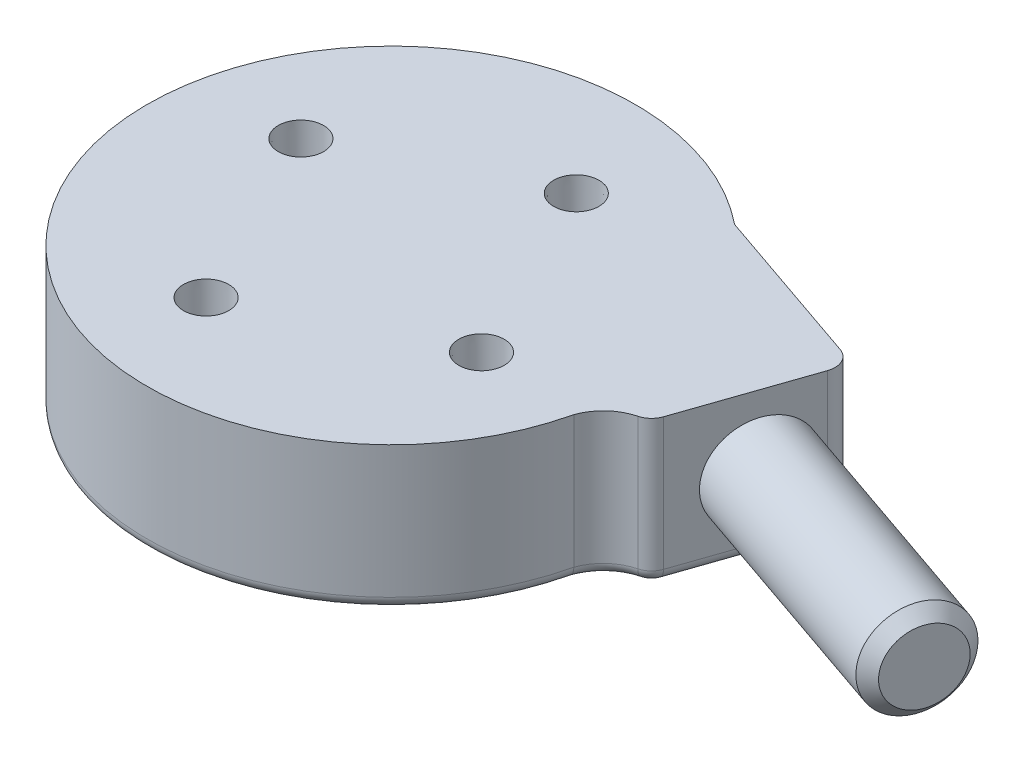
ISO-10303-21;
HEADER;
FILE_DESCRIPTION(('STEP AP214'),'2;1');
FILE_NAME('part.step','',(''),(''),'','','');
FILE_SCHEMA(('AUTOMOTIVE_DESIGN { 1 0 10303 214 1 1 1 1 }'));
ENDSEC;
DATA;
#1=APPLICATION_CONTEXT('core data for automotive mechanical design processes');
#2=APPLICATION_PROTOCOL_DEFINITION('international standard','automotive_design',2000,#1);
#3=PRODUCT_CONTEXT('',#1,'mechanical');
#4=PRODUCT('Part','Part','',(#3));
#5=PRODUCT_RELATED_PRODUCT_CATEGORY('part','',(#4));
#6=PRODUCT_DEFINITION_FORMATION('','',#4);
#7=PRODUCT_DEFINITION_CONTEXT('part definition',#1,'design');
#8=PRODUCT_DEFINITION('design','',#6,#7);
#9=PRODUCT_DEFINITION_SHAPE('','',#8);
#10=(LENGTH_UNIT() NAMED_UNIT(*) SI_UNIT(.MILLI.,.METRE.));
#11=(NAMED_UNIT(*) PLANE_ANGLE_UNIT() SI_UNIT($,.RADIAN.));
#12=(NAMED_UNIT(*) SI_UNIT($,.STERADIAN.) SOLID_ANGLE_UNIT());
#13=UNCERTAINTY_MEASURE_WITH_UNIT(LENGTH_MEASURE(1.E-05),#10,'distance_accuracy_value','');
#14=(GEOMETRIC_REPRESENTATION_CONTEXT(3) GLOBAL_UNCERTAINTY_ASSIGNED_CONTEXT((#13)) GLOBAL_UNIT_ASSIGNED_CONTEXT((#10,
#11,#12)) REPRESENTATION_CONTEXT('',''));
#15=CARTESIAN_POINT('',(0.,0.,0.));
#16=DIRECTION('',(0.,0.,1.));
#17=DIRECTION('',(1.,0.,0.));
#18=AXIS2_PLACEMENT_3D('',#15,#16,#17);
#19=CARTESIAN_POINT('',(-264.046286298938,-160.663775743606,-242.023928087351));
#20=DIRECTION('',(0.,-1.,0.));
#21=DIRECTION('',(0.,0.,-1.00000000000001));
#22=AXIS2_PLACEMENT_3D('',#19,#20,#21);
#23=PLANE('',#22);
#24=CARTESIAN_POINT('',(-245.852404074912,-160.663775743606,-235.758135864115));
#25=DIRECTION('',(0.,1.,0.));
#26=DIRECTION('',(0.,0.,1.00000000000001));
#27=AXIS2_PLACEMENT_3D('',#24,#25,#26);
#28=CIRCLE('',#27,2.99720000000001);
#29=CARTESIAN_POINT('',(-245.852404074912,-160.663775743606,-232.760935864115));
#30=VERTEX_POINT('',#29);
#31=EDGE_CURVE('E147',#30,#30,#28,.T.);
#32=ORIENTED_EDGE('',*,*,#31,.F.);
#33=EDGE_LOOP('',(#32));
#34=FACE_BOUND('',#33,.T.);
#35=CARTESIAN_POINT('',(-270.312078522173,-160.663775743606,-223.830045863326));
#36=DIRECTION('',(0.,1.,0.));
#37=DIRECTION('',(0.,0.,1.00000000000001));
#38=AXIS2_PLACEMENT_3D('',#35,#36,#37);
#39=CIRCLE('',#38,2.99720000000003);
#40=CARTESIAN_POINT('',(-270.312078522173,-160.663775743606,-220.832845863326));
#41=VERTEX_POINT('',#40);
#42=EDGE_CURVE('E153',#41,#41,#39,.T.);
#43=ORIENTED_EDGE('',*,*,#42,.F.);
#44=EDGE_LOOP('',(#43));
#45=FACE_BOUND('',#44,.T.);
#46=CARTESIAN_POINT('',(-257.780494075701,-160.663775743606,-260.217810311378));
#47=DIRECTION('',(0.,1.,0.));
#48=DIRECTION('',(0.,0.,1.00000000000001));
#49=AXIS2_PLACEMENT_3D('',#46,#47,#48);
#50=CIRCLE('',#49,2.99720000000003);
#51=CARTESIAN_POINT('',(-257.780494075701,-160.663775743606,-257.220610311378));
#52=VERTEX_POINT('',#51);
#53=EDGE_CURVE('E165',#52,#52,#50,.T.);
#54=ORIENTED_EDGE('',*,*,#53,.F.);
#55=EDGE_LOOP('',(#54));
#56=FACE_BOUND('',#55,.T.);
#57=DIRECTION('',(-0.325620940566078,0.,0.945500398236233));
#58=VECTOR('',#57,1.);
#59=CARTESIAN_POINT('',(-226.943146120788,-160.663775743606,-238.965283020514));
#60=LINE('',#59,#58);
#61=CARTESIAN_POINT('',(-220.887958291581,-160.663775743605,-256.547636581552));
#62=VERTEX_POINT('',#61);
#63=CARTESIAN_POINT('',(-226.447767440721,-160.663775743606,-240.403706294109));
#64=VERTEX_POINT('',#63);
#65=EDGE_CURVE('E177',#62,#64,#60,.T.);
#66=ORIENTED_EDGE('',*,*,#65,.F.);
#67=CARTESIAN_POINT('',(-223.289529303101,-160.663775743606,-257.374713770591));
#68=DIRECTION('',(0.,-1.,0.));
#69=DIRECTION('',(0.,0.,-1.00000000000001));
#70=AXIS2_PLACEMENT_3D('',#67,#68,#69);
#71=CIRCLE('',#70,2.54);
#72=CARTESIAN_POINT('',(-222.462452114064,-160.663775743606,-259.776284782109));
#73=VERTEX_POINT('',#72);
#74=EDGE_CURVE('E206',#62,#73,#71,.F.);
#75=ORIENTED_EDGE('',*,*,#74,.T.);
#76=DIRECTION('',(0.945500398236233,0.,0.325620940566077));
#77=VECTOR('',#76,1.);
#78=CARTESIAN_POINT('',(-220.060881102543,-160.663775743606,-258.94920759307));
#79=LINE('',#78,#77);
#80=CARTESIAN_POINT('',(-243.756619181763,-160.663775743605,-267.10978429421));
#81=VERTEX_POINT('',#80);
#82=EDGE_CURVE('E181',#81,#73,#79,.T.);
#83=ORIENTED_EDGE('',*,*,#82,.F.);
#84=CARTESIAN_POINT('',(-264.046286298938,-160.663775743606,-242.023928087351));
#85=DIRECTION('',(0.,-1.,0.));
#86=DIRECTION('',(0.,0.,-1.00000000000001));
#87=AXIS2_PLACEMENT_3D('',#84,#85,#86);
#88=CIRCLE('',#87,32.264078684458);
#89=CARTESIAN_POINT('',(-232.618969714269,-160.663775743604,-234.723616748524));
#90=VERTEX_POINT('',#89);
#91=EDGE_CURVE('E176',#90,#81,#88,.T.);
#92=ORIENTED_EDGE('',*,*,#91,.F.);
#93=CARTESIAN_POINT('',(-226.626416439824,-160.663775743606,-232.623186970375));
#94=DIRECTION('',(0.,-1.,0.));
#95=DIRECTION('',(0.,0.,-1.00000000000001));
#96=AXIS2_PLACEMENT_3D('',#93,#94,#95);
#97=CIRCLE('',#96,6.35);
#98=CARTESIAN_POINT('',(-228.214217877266,-160.663775743605,-238.771470193785));
#99=VERTEX_POINT('',#98);
#100=EDGE_CURVE('E195',#90,#99,#97,.T.);
#101=ORIENTED_EDGE('',*,*,#100,.T.);
#102=CARTESIAN_POINT('',(-228.849338452243,-160.663775743605,-241.230783483149));
#103=DIRECTION('',(0.,-1.,0.));
#104=DIRECTION('',(0.,0.,-1.00000000000001));
#105=AXIS2_PLACEMENT_3D('',#102,#103,#104);
#106=CIRCLE('',#105,2.54);
#107=EDGE_CURVE('E204',#99,#64,#106,.F.);
#108=ORIENTED_EDGE('',*,*,#107,.T.);
#109=EDGE_LOOP('',(#66,#75,#83,#92,#101,#108));
#110=FACE_BOUND('',#109,.T.);
#111=CARTESIAN_POINT('',(-282.240168522964,-160.663775743605,-248.289720310586));
#112=DIRECTION('',(0.,1.,0.));
#113=DIRECTION('',(0.,0.,1.00000000000001));
#114=AXIS2_PLACEMENT_3D('',#111,#112,#113);
#115=CIRCLE('',#114,2.99720000000003);
#116=CARTESIAN_POINT('',(-282.240168522964,-160.663775743605,-245.292520310586));
#117=VERTEX_POINT('',#116);
#118=EDGE_CURVE('E159',#117,#117,#115,.T.);
#119=ORIENTED_EDGE('',*,*,#118,.F.);
#120=EDGE_LOOP('',(#119));
#121=FACE_BOUND('',#120,.T.);
#122=ADVANCED_FACE('F40',(#34,#45,#56,#110,#121),#23,.F.);
#123=CARTESIAN_POINT('',(-264.046286298938,-175.975505735528,-242.023928087351));
#124=DIRECTION('',(0.,1.,0.));
#125=DIRECTION('',(0.,0.,1.00000000000001));
#126=AXIS2_PLACEMENT_3D('',#123,#124,#125);
#127=CYLINDRICAL_SURFACE('',#126,32.264078684458);
#128=DIRECTION('',(0.,-1.,0.));
#129=VECTOR('',#128,1.);
#130=CARTESIAN_POINT('',(-243.756619181763,-163.275505735527,-267.10978429421));
#131=LINE('',#130,#129);
#132=CARTESIAN_POINT('',(-243.756619181762,-178.126275743605,-267.109784294209));
#133=VERTEX_POINT('',#132);
#134=EDGE_CURVE('E180',#81,#133,#131,.T.);
#135=ORIENTED_EDGE('',*,*,#134,.T.);
#136=CARTESIAN_POINT('',(-264.046286298938,-178.126275743606,-242.023928087351));
#137=DIRECTION('',(0.,-1.,0.));
#138=DIRECTION('',(0.,0.,-1.00000000000001));
#139=AXIS2_PLACEMENT_3D('',#136,#137,#138);
#140=CIRCLE('',#139,32.264078684458);
#141=CARTESIAN_POINT('',(-232.618969714268,-178.126275743604,-234.723616748525));
#142=VERTEX_POINT('',#141);
#143=EDGE_CURVE('E223',#133,#142,#140,.F.);
#144=ORIENTED_EDGE('',*,*,#143,.T.);
#145=DIRECTION('',(0.,1.,0.));
#146=VECTOR('',#145,1.);
#147=CARTESIAN_POINT('',(-232.618969714269,-170.188775743604,-234.723616748525));
#148=LINE('',#147,#146);
#149=EDGE_CURVE('E193',#142,#90,#148,.T.);
#150=ORIENTED_EDGE('',*,*,#149,.T.);
#151=ORIENTED_EDGE('',*,*,#91,.T.);
#152=EDGE_LOOP('',(#135,#144,#150,#151));
#153=FACE_BOUND('',#152,.T.);
#154=ADVANCED_FACE('F273',(#153),#127,.T.);
#155=CARTESIAN_POINT('',(-220.060881102543,-163.275505735528,-258.94920759307));
#156=DIRECTION('',(0.945500398236233,0.,0.325620940566078));
#157=DIRECTION('',(0.325620940566078,0.,-0.945500398236233));
#158=AXIS2_PLACEMENT_3D('',#155,#156,#157);
#159=PLANE('',#158);
#160=CARTESIAN_POINT('',(-223.163344663644,-170.188775743606,-249.940632998837));
#161=DIRECTION('',(0.945500398236233,0.,0.325620940566078));
#162=DIRECTION('',(0.325620940566078,0.,-0.945500398236233));
#163=AXIS2_PLACEMENT_3D('',#160,#161,#162);
#164=CIRCLE('',#163,6.35);
#165=CARTESIAN_POINT('',(-221.095651691049,-170.188775743606,-255.944560527637));
#166=VERTEX_POINT('',#165);
#167=EDGE_CURVE('E172',#166,#166,#164,.T.);
#168=ORIENTED_EDGE('',*,*,#167,.F.);
#169=EDGE_LOOP('',(#168));
#170=FACE_BOUND('',#169,.T.);
#171=DIRECTION('',(0.,-1.,0.));
#172=VECTOR('',#171,1.);
#173=CARTESIAN_POINT('',(-226.447767440722,-179.713775743606,-240.40370629411));
#174=LINE('',#173,#172);
#175=CARTESIAN_POINT('',(-226.447767440721,-178.126275743606,-240.40370629411));
#176=VERTEX_POINT('',#175);
#177=EDGE_CURVE('E200',#64,#176,#174,.T.);
#178=ORIENTED_EDGE('',*,*,#177,.T.);
#179=DIRECTION('',(-0.325620940566078,0.,0.945500398236233));
#180=VECTOR('',#179,1.);
#181=CARTESIAN_POINT('',(-220.060881102542,-178.126275743606,-258.949207593071));
#182=LINE('',#181,#180);
#183=CARTESIAN_POINT('',(-220.88795829158,-178.126275743605,-256.547636581552));
#184=VERTEX_POINT('',#183);
#185=EDGE_CURVE('E64',#176,#184,#182,.F.);
#186=ORIENTED_EDGE('',*,*,#185,.T.);
#187=DIRECTION('',(0.,-1.,0.));
#188=VECTOR('',#187,1.);
#189=CARTESIAN_POINT('',(-220.887958291581,-163.275505735527,-256.547636581552));
#190=LINE('',#189,#188);
#191=EDGE_CURVE('E202',#184,#62,#190,.F.);
#192=ORIENTED_EDGE('',*,*,#191,.T.);
#193=ORIENTED_EDGE('',*,*,#65,.T.);
#194=EDGE_LOOP('',(#178,#186,#192,#193));
#195=FACE_BOUND('',#194,.T.);
#196=ADVANCED_FACE('F279',(#170,#195),#159,.T.);
#197=CARTESIAN_POINT('',(-243.756619181763,-163.275505735527,-267.10978429421));
#198=DIRECTION('',(0.325620940566077,0.,-0.945500398236233));
#199=DIRECTION('',(-0.945500398236233,0.,-0.325620940566077));
#200=AXIS2_PLACEMENT_3D('',#197,#198,#199);
#201=PLANE('',#200);
#202=DIRECTION('',(0.,-1.,0.));
#203=VECTOR('',#202,1.);
#204=CARTESIAN_POINT('',(-222.462452114064,-163.275505735528,-259.776284782109));
#205=LINE('',#204,#203);
#206=CARTESIAN_POINT('',(-222.462452114063,-178.126275743606,-259.776284782111));
#207=VERTEX_POINT('',#206);
#208=EDGE_CURVE('E198',#73,#207,#205,.T.);
#209=ORIENTED_EDGE('',*,*,#208,.T.);
#210=DIRECTION('',(0.945500398236233,0.,0.325620940566077));
#211=VECTOR('',#210,1.);
#212=CARTESIAN_POINT('',(-243.756619181762,-178.126275743605,-267.109784294209));
#213=LINE('',#212,#211);
#214=EDGE_CURVE('E12',#207,#133,#213,.F.);
#215=ORIENTED_EDGE('',*,*,#214,.T.);
#216=ORIENTED_EDGE('',*,*,#134,.F.);
#217=ORIENTED_EDGE('',*,*,#82,.T.);
#218=EDGE_LOOP('',(#209,#215,#216,#217));
#219=FACE_BOUND('',#218,.T.);
#220=ADVANCED_FACE('F285',(#219),#201,.T.);
#221=CARTESIAN_POINT('',(-264.046286298938,-179.713775743606,-242.023928087351));
#222=DIRECTION('',(0.,-1.,0.));
#223=DIRECTION('',(0.,0.,-1.00000000000001));
#224=AXIS2_PLACEMENT_3D('',#221,#222,#223);
#225=PLANE('',#224);
#226=CARTESIAN_POINT('',(-226.626416439824,-179.713775743606,-232.623186970375));
#227=DIRECTION('',(0.,-1.,0.));
#228=DIRECTION('',(0.,0.,-1.00000000000001));
#229=AXIS2_PLACEMENT_3D('',#226,#227,#228);
#230=CIRCLE('',#229,7.9375);
#231=CARTESIAN_POINT('',(-228.611168236625,-179.713775743605,-240.308540999639));
#232=VERTEX_POINT('',#231);
#233=CARTESIAN_POINT('',(-234.147165949107,-179.713775743604,-235.161342416486));
#234=VERTEX_POINT('',#233);
#235=EDGE_CURVE('E218',#232,#234,#230,.F.);
#236=ORIENTED_EDGE('',*,*,#235,.T.);
#237=CARTESIAN_POINT('',(-264.046286298938,-179.713775743606,-242.023928087351));
#238=DIRECTION('',(0.,-1.,0.));
#239=DIRECTION('',(0.,0.,-1.00000000000001));
#240=AXIS2_PLACEMENT_3D('',#237,#238,#239);
#241=CIRCLE('',#240,30.676578684458);
#242=CARTESIAN_POINT('',(-244.541144822364,-179.713775743606,-265.700962018201));
#243=VERTEX_POINT('',#242);
#244=EDGE_CURVE('E220',#234,#243,#241,.T.);
#245=ORIENTED_EDGE('',*,*,#244,.T.);
#246=DIRECTION('',(0.945500398236233,0.,0.325620940566077));
#247=VECTOR('',#246,1.);
#248=CARTESIAN_POINT('',(-254.688615308605,-179.713775743606,-269.19565000592));
#249=LINE('',#248,#247);
#250=CARTESIAN_POINT('',(-222.97937535721,-179.713775743606,-258.27530289991));
#251=VERTEX_POINT('',#250);
#252=EDGE_CURVE('E210',#243,#251,#249,.T.);
#253=ORIENTED_EDGE('',*,*,#252,.T.);
#254=CARTESIAN_POINT('',(-223.289529303101,-179.713775743606,-257.37471377059));
#255=DIRECTION('',(0.,-1.,0.));
#256=DIRECTION('',(0.,0.,-1.00000000000001));
#257=AXIS2_PLACEMENT_3D('',#254,#255,#256);
#258=CIRCLE('',#257,0.9525);
#259=CARTESIAN_POINT('',(-222.388940173779,-179.713775743605,-257.0645598247));
#260=VERTEX_POINT('',#259);
#261=EDGE_CURVE('E212',#251,#260,#258,.T.);
#262=ORIENTED_EDGE('',*,*,#261,.T.);
#263=DIRECTION('',(-0.325620940566078,0.,0.945500398236233));
#264=VECTOR('',#263,1.);
#265=CARTESIAN_POINT('',(-231.436457218225,-179.713775743605,-230.793427035455));
#266=LINE('',#265,#264);
#267=CARTESIAN_POINT('',(-227.948749322922,-179.713775743605,-240.920629537262));
#268=VERTEX_POINT('',#267);
#269=EDGE_CURVE('E214',#260,#268,#266,.T.);
#270=ORIENTED_EDGE('',*,*,#269,.T.);
#271=CARTESIAN_POINT('',(-228.849338452241,-179.713775743605,-241.230783483148));
#272=DIRECTION('',(0.,-1.,0.));
#273=DIRECTION('',(0.,0.,-1.00000000000001));
#274=AXIS2_PLACEMENT_3D('',#271,#272,#273);
#275=CIRCLE('',#274,0.9525);
#276=EDGE_CURVE('E216',#268,#232,#275,.T.);
#277=ORIENTED_EDGE('',*,*,#276,.T.);
#278=EDGE_LOOP('',(#236,#245,#253,#262,#270,#277));
#279=FACE_BOUND('',#278,.T.);
#280=ADVANCED_FACE('F397',(#279),#225,.T.);
#281=CARTESIAN_POINT('',(-190.141743255245,-170.188775743606,-238.568321649567));
#282=DIRECTION('',(-0.945500398236233,0.,-0.325620940566078));
#283=DIRECTION('',(-0.325620940566078,0.,0.945500398236233));
#284=AXIS2_PLACEMENT_3D('',#281,#282,#283);
#285=CYLINDRICAL_SURFACE('',#284,6.35);
#286=CARTESIAN_POINT('',(-191.642725137444,-170.188775743606,-239.085244892717));
#287=DIRECTION('',(0.945500398236234,0.,0.325620940566075));
#288=DIRECTION('',(0.325620940566075,0.,-0.945500398236234));
#289=AXIS2_PLACEMENT_3D('',#286,#287,#288);
#290=CIRCLE('',#289,6.35);
#291=CARTESIAN_POINT('',(-189.575032164849,-170.188775743606,-245.089172421517));
#292=VERTEX_POINT('',#291);
#293=EDGE_CURVE('E190',#292,#292,#290,.F.);
#294=ORIENTED_EDGE('',*,*,#293,.T.);
#295=EDGE_LOOP('',(#294));
#296=FACE_BOUND('',#295,.T.);
#297=ORIENTED_EDGE('',*,*,#167,.T.);
#298=EDGE_LOOP('',(#297));
#299=FACE_BOUND('',#298,.T.);
#300=ADVANCED_FACE('F393',(#296,#299),#285,.T.);
#301=CARTESIAN_POINT('',(-190.141743255245,-170.188775743606,-238.568321649567));
#302=DIRECTION('',(0.945500398236233,0.,0.325620940566078));
#303=DIRECTION('',(0.325620940566078,0.,-0.945500398236233));
#304=AXIS2_PLACEMENT_3D('',#301,#302,#303);
#305=PLANE('',#304);
#306=CARTESIAN_POINT('',(-190.141743255245,-170.188775743606,-238.568321649567));
#307=DIRECTION('',(0.945500398236233,0.,0.325620940566078));
#308=DIRECTION('',(0.325620940566078,0.,-0.945500398236233));
#309=AXIS2_PLACEMENT_3D('',#306,#307,#308);
#310=CIRCLE('',#309,4.76249999999991);
#311=CARTESIAN_POINT('',(-188.590973525799,-170.188775743606,-243.071267296167));
#312=VERTEX_POINT('',#311);
#313=EDGE_CURVE('E175',#312,#312,#310,.T.);
#314=ORIENTED_EDGE('',*,*,#313,.T.);
#315=EDGE_LOOP('',(#314));
#316=FACE_BOUND('',#315,.T.);
#317=ADVANCED_FACE('F292',(#316),#305,.T.);
#318=CARTESIAN_POINT('',(-190.141743255245,-170.188775743606,-238.568321649567));
#319=DIRECTION('',(-0.945500398236234,0.,-0.325620940566075));
#320=DIRECTION('',(-0.325620940566075,0.,0.945500398236234));
#321=AXIS2_PLACEMENT_3D('',#318,#319,#320);
#322=CONICAL_SURFACE('',#321,4.76249999999991,0.785398163397448);
#323=ORIENTED_EDGE('',*,*,#293,.F.);
#324=EDGE_LOOP('',(#323));
#325=FACE_BOUND('',#324,.T.);
#326=ORIENTED_EDGE('',*,*,#313,.F.);
#327=EDGE_LOOP('',(#326));
#328=FACE_BOUND('',#327,.T.);
#329=ADVANCED_FACE('F288',(#325,#328),#322,.T.);
#330=CARTESIAN_POINT('',(-226.626416439824,-163.275505735528,-232.623186970375));
#331=DIRECTION('',(0.,1.,0.));
#332=DIRECTION('',(0.,0.,1.00000000000001));
#333=AXIS2_PLACEMENT_3D('',#330,#331,#332);
#334=CYLINDRICAL_SURFACE('',#333,6.35);
#335=ORIENTED_EDGE('',*,*,#149,.F.);
#336=CARTESIAN_POINT('',(-226.626416439824,-178.126275743606,-232.623186970375));
#337=DIRECTION('',(0.,-1.,0.));
#338=DIRECTION('',(0.,0.,-1.00000000000001));
#339=AXIS2_PLACEMENT_3D('',#336,#337,#338);
#340=CIRCLE('',#339,6.35);
#341=CARTESIAN_POINT('',(-228.214217877265,-178.126275743605,-238.771470193787));
#342=VERTEX_POINT('',#341);
#343=EDGE_CURVE('E226',#142,#342,#340,.T.);
#344=ORIENTED_EDGE('',*,*,#343,.T.);
#345=DIRECTION('',(0.,1.,0.));
#346=VECTOR('',#345,1.);
#347=CARTESIAN_POINT('',(-228.214217877266,-163.275505735527,-238.771470193785));
#348=LINE('',#347,#346);
#349=EDGE_CURVE('E208',#342,#99,#348,.T.);
#350=ORIENTED_EDGE('',*,*,#349,.T.);
#351=ORIENTED_EDGE('',*,*,#100,.F.);
#352=EDGE_LOOP('',(#335,#344,#350,#351));
#353=FACE_BOUND('',#352,.T.);
#354=ADVANCED_FACE('F291',(#353),#334,.F.);
#355=CARTESIAN_POINT('',(-223.289529303101,-163.275505735528,-257.374713770591));
#356=DIRECTION('',(0.,-1.,0.));
#357=DIRECTION('',(0.,0.,-1.00000000000001));
#358=AXIS2_PLACEMENT_3D('',#355,#356,#357);
#359=CYLINDRICAL_SURFACE('',#358,2.54);
#360=ORIENTED_EDGE('',*,*,#191,.F.);
#361=CARTESIAN_POINT('',(-223.289529303101,-178.126275743606,-257.374713770589));
#362=DIRECTION('',(0.,-1.,0.));
#363=DIRECTION('',(0.,0.,-1.00000000000001));
#364=AXIS2_PLACEMENT_3D('',#361,#362,#363);
#365=CIRCLE('',#364,2.54);
#366=EDGE_CURVE('E49',#184,#207,#365,.F.);
#367=ORIENTED_EDGE('',*,*,#366,.T.);
#368=ORIENTED_EDGE('',*,*,#208,.F.);
#369=ORIENTED_EDGE('',*,*,#74,.F.);
#370=EDGE_LOOP('',(#360,#367,#368,#369));
#371=FACE_BOUND('',#370,.T.);
#372=ADVANCED_FACE('F296',(#371),#359,.T.);
#373=CARTESIAN_POINT('',(-228.849338452243,-163.275505735527,-241.230783483149));
#374=DIRECTION('',(0.,1.,0.));
#375=DIRECTION('',(0.,0.,1.00000000000001));
#376=AXIS2_PLACEMENT_3D('',#373,#374,#375);
#377=CYLINDRICAL_SURFACE('',#376,2.54);
#378=ORIENTED_EDGE('',*,*,#349,.F.);
#379=CARTESIAN_POINT('',(-228.849338452241,-178.126275743605,-241.230783483148));
#380=DIRECTION('',(0.,-1.,0.));
#381=DIRECTION('',(0.,0.,-1.00000000000001));
#382=AXIS2_PLACEMENT_3D('',#379,#380,#381);
#383=CIRCLE('',#382,2.54);
#384=EDGE_CURVE('E228',#342,#176,#383,.F.);
#385=ORIENTED_EDGE('',*,*,#384,.T.);
#386=ORIENTED_EDGE('',*,*,#177,.F.);
#387=ORIENTED_EDGE('',*,*,#107,.F.);
#388=EDGE_LOOP('',(#378,#385,#386,#387));
#389=FACE_BOUND('',#388,.T.);
#390=ADVANCED_FACE('F269',(#389),#377,.T.);
#391=CARTESIAN_POINT('',(-231.436457218225,-178.126275743605,-230.793427035455));
#392=DIRECTION('',(-0.325620940566078,0.,0.945500398236233));
#393=DIRECTION('',(0.945500398236233,0.,0.325620940566078));
#394=AXIS2_PLACEMENT_3D('',#391,#392,#393);
#395=CYLINDRICAL_SURFACE('',#394,1.5875);
#396=CARTESIAN_POINT('',(-222.388940173779,-178.126275743605,-257.0645598247));
#397=DIRECTION('',(0.325620940566058,0.,-0.945500398236235));
#398=DIRECTION('',(-0.945500398236235,0.,-0.325620940566058));
#399=AXIS2_PLACEMENT_3D('',#396,#397,#398);
#400=CIRCLE('',#399,1.5875);
#401=EDGE_CURVE('E316',#184,#260,#400,.T.);
#402=ORIENTED_EDGE('',*,*,#401,.F.);
#403=ORIENTED_EDGE('',*,*,#185,.F.);
#404=CARTESIAN_POINT('',(-227.948749322922,-178.126275743605,-240.920629537262));
#405=DIRECTION('',(-0.325620940566081,0.,0.945500398236233));
#406=DIRECTION('',(0.945500398236233,0.,0.325620940566081));
#407=AXIS2_PLACEMENT_3D('',#404,#405,#406);
#408=CIRCLE('',#407,1.5875);
#409=EDGE_CURVE('E184',#268,#176,#408,.T.);
#410=ORIENTED_EDGE('',*,*,#409,.F.);
#411=ORIENTED_EDGE('',*,*,#269,.F.);
#412=EDGE_LOOP('',(#402,#403,#410,#411));
#413=FACE_BOUND('',#412,.T.);
#414=ADVANCED_FACE('F42',(#413),#395,.T.);
#415=CARTESIAN_POINT('',(-228.849338452241,-178.126275743605,-241.230783483148));
#416=DIRECTION('',(0.,-1.,0.));
#417=DIRECTION('',(0.,0.,-1.00000000000001));
#418=AXIS2_PLACEMENT_3D('',#415,#416,#417);
#419=DEGENERATE_TOROIDAL_SURFACE('',#418,0.9525,1.5875,.T.);
#420=ORIENTED_EDGE('',*,*,#409,.T.);
#421=ORIENTED_EDGE('',*,*,#384,.F.);
#422=CARTESIAN_POINT('',(-228.611168236625,-178.126275743605,-240.308540999639));
#423=DIRECTION('',(-0.968233578489693,0.,0.250047470463221));
#424=DIRECTION('',(0.250047470463221,0.,0.968233578489693));
#425=AXIS2_PLACEMENT_3D('',#422,#423,#424);
#426=CIRCLE('',#425,1.5875);
#427=EDGE_CURVE('E311',#232,#342,#426,.T.);
#428=ORIENTED_EDGE('',*,*,#427,.F.);
#429=ORIENTED_EDGE('',*,*,#276,.F.);
#430=EDGE_LOOP('',(#420,#421,#428,#429));
#431=FACE_BOUND('',#430,.T.);
#432=ADVANCED_FACE('F262',(#431),#419,.T.);
#433=CARTESIAN_POINT('',(-223.289529303101,-178.126275743606,-257.374713770589));
#434=DIRECTION('',(0.,-1.,0.));
#435=DIRECTION('',(0.,0.,-1.00000000000001));
#436=AXIS2_PLACEMENT_3D('',#433,#434,#435);
#437=DEGENERATE_TOROIDAL_SURFACE('',#436,0.9525,1.5875,.T.);
#438=ORIENTED_EDGE('',*,*,#401,.T.);
#439=ORIENTED_EDGE('',*,*,#261,.F.);
#440=CARTESIAN_POINT('',(-222.97937535721,-178.126275743606,-258.275302899909));
#441=DIRECTION('',(-0.945500398236233,0.,-0.325620940566081));
#442=DIRECTION('',(-0.325620940566081,0.,0.945500398236233));
#443=AXIS2_PLACEMENT_3D('',#440,#441,#442);
#444=CIRCLE('',#443,1.5875);
#445=EDGE_CURVE('E317',#207,#251,#444,.T.);
#446=ORIENTED_EDGE('',*,*,#445,.F.);
#447=ORIENTED_EDGE('',*,*,#366,.F.);
#448=EDGE_LOOP('',(#438,#439,#446,#447));
#449=FACE_BOUND('',#448,.T.);
#450=ADVANCED_FACE('F259',(#449),#437,.T.);
#451=CARTESIAN_POINT('',(-226.626416439824,-178.126275743606,-232.623186970375));
#452=DIRECTION('',(0.,-1.,0.));
#453=DIRECTION('',(0.,0.,-1.00000000000001));
#454=AXIS2_PLACEMENT_3D('',#451,#452,#453);
#455=TOROIDAL_SURFACE('',#454,7.9375,1.5875);
#456=ORIENTED_EDGE('',*,*,#427,.T.);
#457=ORIENTED_EDGE('',*,*,#343,.F.);
#458=CARTESIAN_POINT('',(-232.618969714268,-178.126275743604,-234.723616748525));
#459=CARTESIAN_POINT('',(-232.618969988091,-178.170891437512,-234.7236167354));
#460=CARTESIAN_POINT('',(-232.620779723182,-178.215485737574,-234.72414250016));
#461=CARTESIAN_POINT('',(-232.627999405114,-178.30435485595,-234.726239365983));
#462=CARTESIAN_POINT('',(-232.633409168138,-178.348629690457,-234.727810413675));
#463=CARTESIAN_POINT('',(-232.65498729982,-178.480423837321,-234.734075435683));
#464=CARTESIAN_POINT('',(-232.676504651982,-178.567059647775,-234.740321334651));
#465=CARTESIAN_POINT('',(-232.733204272421,-178.735336072673,-234.756762497034));
#466=CARTESIAN_POINT('',(-232.768392839344,-178.816974364547,-234.766959580845));
#467=CARTESIAN_POINT('',(-232.851429407218,-178.972940828414,-234.790988560355));
#468=CARTESIAN_POINT('',(-232.899274575127,-179.047270631232,-234.804819642619));
#469=CARTESIAN_POINT('',(-233.006304268184,-179.186570833005,-234.83570762717));
#470=CARTESIAN_POINT('',(-233.065496040047,-179.251535203847,-234.852766590913));
#471=CARTESIAN_POINT('',(-233.193548274022,-179.370240233853,-234.889600743267));
#472=CARTESIAN_POINT('',(-233.2624120144,-179.423977072075,-234.909376852793));
#473=CARTESIAN_POINT('',(-233.40795219956,-179.518761858054,-234.951087180574));
#474=CARTESIAN_POINT('',(-233.484641265299,-179.559788862797,-234.9730248831));
#475=CARTESIAN_POINT('',(-233.643543417959,-179.627852400759,-235.018383887567));
#476=CARTESIAN_POINT('',(-233.725751589022,-179.654901202335,-235.041803868208));
#477=CARTESIAN_POINT('',(-233.86094012525,-179.686687821993,-235.080235679753));
#478=CARTESIAN_POINT('',(-233.912961875454,-179.696007174887,-235.095005872769));
#479=CARTESIAN_POINT('',(-234.017612009569,-179.709012510463,-235.124680620993));
#480=CARTESIAN_POINT('',(-234.070239342299,-179.712707099568,-235.139584935757));
#481=CARTESIAN_POINT('',(-234.130976316729,-179.713709188533,-235.156764475511));
#482=CARTESIAN_POINT('',(-234.139071554109,-179.713775920114,-235.159053785155));
#483=CARTESIAN_POINT('',(-234.147165949107,-179.713775743604,-235.161342416486));
#484=B_SPLINE_CURVE_WITH_KNOTS('',3,(#458,#459,#460,#461,#462,#463,#464,#465,#466,#467,#468,
#469,#470,#471,#472,#473,#474,#475,#476,#477,#478,#479,#480,#481,#482,#483),.UNSPECIFIED.,.F.,
.F.,(4,2,2,2,2,2,2,2,2,2,2,2,4),(0.,0.133764807401802,0.267522785403915,0.534603788683154,
0.801807988548841,1.06895242819065,1.3362680563725,1.60367450946267,1.87151927430165,
2.13912855676501,2.30350432287921,2.46762832475175,2.4928660309918),.UNSPECIFIED.);
#485=EDGE_CURVE('E239',#234,#142,#484,.F.);
#486=ORIENTED_EDGE('',*,*,#485,.F.);
#487=ORIENTED_EDGE('',*,*,#235,.F.);
#488=EDGE_LOOP('',(#456,#457,#486,#487));
#489=FACE_BOUND('',#488,.T.);
#490=ADVANCED_FACE('F254',(#489),#455,.T.);
#491=CARTESIAN_POINT('',(-254.688615308605,-178.126275743606,-269.195650005919));
#492=DIRECTION('',(0.945500398236233,0.,0.325620940566077));
#493=DIRECTION('',(0.325620940566077,0.,-0.945500398236233));
#494=AXIS2_PLACEMENT_3D('',#491,#492,#493);
#495=CYLINDRICAL_SURFACE('',#494,1.5875);
#496=ORIENTED_EDGE('',*,*,#445,.T.);
#497=ORIENTED_EDGE('',*,*,#252,.F.);
#498=CARTESIAN_POINT('',(-243.756619181762,-178.126275743605,-267.109784294209));
#499=CARTESIAN_POINT('',(-243.756619196829,-178.170444006586,-267.109784361741));
#500=CARTESIAN_POINT('',(-243.75752671294,-178.214590939198,-267.10814602429));
#501=CARTESIAN_POINT('',(-243.761146279745,-178.302565205432,-267.101612239352));
#502=CARTESIAN_POINT('',(-243.763858190612,-178.346392563551,-267.096717044245));
#503=CARTESIAN_POINT('',(-243.774670579625,-178.476815936174,-267.077201414215));
#504=CARTESIAN_POINT('',(-243.785447811861,-178.56253225527,-267.057750752209));
#505=CARTESIAN_POINT('',(-243.813821634956,-178.729002264534,-267.006559724951));
#506=CARTESIAN_POINT('',(-243.83142047791,-178.809754305578,-266.974815301025));
#507=CARTESIAN_POINT('',(-243.872913957096,-178.964072876423,-266.900005905696));
#508=CARTESIAN_POINT('',(-243.896807898039,-179.037640198543,-266.856942184506));
#509=CARTESIAN_POINT('',(-243.950371865354,-179.17604425011,-266.760461644683));
#510=CARTESIAN_POINT('',(-243.980078295347,-179.240821355341,-266.706979585837));
#511=CARTESIAN_POINT('',(-244.044326884088,-179.359381037403,-266.591390054983));
#512=CARTESIAN_POINT('',(-244.078870627599,-179.413159996843,-266.52927975631));
#513=CARTESIAN_POINT('',(-244.152351681798,-179.509009450799,-266.397262602125));
#514=CARTESIAN_POINT('',(-244.191345656854,-179.550898002325,-266.327255365536));
#515=CARTESIAN_POINT('',(-244.272213062291,-179.620818483281,-266.182196288107));
#516=CARTESIAN_POINT('',(-244.31408489677,-179.648858023104,-266.107147243691));
#517=CARTESIAN_POINT('',(-244.385897927157,-179.683787841728,-265.97854902346));
#518=CARTESIAN_POINT('',(-244.41539089751,-179.694569891194,-265.92576628423));
#519=CARTESIAN_POINT('',(-244.474776750905,-179.709278485932,-265.819551195551));
#520=CARTESIAN_POINT('',(-244.504668857282,-179.713216812032,-265.766120122175));
#521=CARTESIAN_POINT('',(-244.53675744903,-179.713757334551,-265.70879883793));
#522=CARTESIAN_POINT('',(-244.538951172081,-179.71377579166,-265.704880272713));
#523=CARTESIAN_POINT('',(-244.541144822364,-179.713775743606,-265.700962018201));
#524=B_SPLINE_CURVE_WITH_KNOTS('',3,(#498,#499,#500,#501,#502,#503,#504,#505,#506,#507,#508,
#509,#510,#511,#512,#513,#514,#515,#516,#517,#518,#519,#520,#521,#522,#523),.UNSPECIFIED.,.F.,
.F.,(4,2,2,2,2,2,2,2,2,2,2,2,4),(0.,0.132422819637891,0.264835378778555,0.529130361215074,
0.793512672719985,1.05786579558224,1.3239308580908,1.59008329159642,1.86011224672504,
2.12999264833363,2.31390587572502,2.49750219892179,2.51097462936191),.UNSPECIFIED.);
#525=EDGE_CURVE('E171',#133,#243,#524,.T.);
#526=ORIENTED_EDGE('',*,*,#525,.F.);
#527=ORIENTED_EDGE('',*,*,#214,.F.);
#528=EDGE_LOOP('',(#496,#497,#526,#527));
#529=FACE_BOUND('',#528,.T.);
#530=ADVANCED_FACE('F246',(#529),#495,.T.);
#531=CARTESIAN_POINT('',(-264.046286298938,-178.126275743606,-242.023928087351));
#532=DIRECTION('',(0.,-1.,0.));
#533=DIRECTION('',(0.,0.,-1.00000000000001));
#534=AXIS2_PLACEMENT_3D('',#531,#532,#533);
#535=TOROIDAL_SURFACE('',#534,30.676578684458,1.5875);
#536=ORIENTED_EDGE('',*,*,#485,.T.);
#537=ORIENTED_EDGE('',*,*,#143,.F.);
#538=ORIENTED_EDGE('',*,*,#525,.T.);
#539=ORIENTED_EDGE('',*,*,#244,.F.);
#540=EDGE_LOOP('',(#536,#537,#538,#539));
#541=FACE_BOUND('',#540,.T.);
#542=ADVANCED_FACE('F249',(#541),#535,.T.);
#543=CARTESIAN_POINT('',(-257.780494075701,-165.362775743606,-260.217810311378));
#544=DIRECTION('',(0.,-1.,0.));
#545=DIRECTION('',(0.,0.,-1.00000000000001));
#546=AXIS2_PLACEMENT_3D('',#543,#544,#545);
#547=PLANE('',#546);
#548=CARTESIAN_POINT('',(-257.780494075701,-165.362775743606,-260.217810311378));
#549=DIRECTION('',(0.,-1.,0.));
#550=DIRECTION('',(0.,0.,-1.00000000000001));
#551=AXIS2_PLACEMENT_3D('',#548,#549,#550);
#552=CIRCLE('',#551,2.45744999999997);
#553=CARTESIAN_POINT('',(-257.780494075701,-165.362775743606,-262.675260311378));
#554=VERTEX_POINT('',#553);
#555=EDGE_CURVE('E146',#554,#554,#552,.T.);
#556=ORIENTED_EDGE('',*,*,#555,.T.);
#557=EDGE_LOOP('',(#556));
#558=FACE_BOUND('',#557,.T.);
#559=CARTESIAN_POINT('',(-257.780494075701,-165.362775743606,-260.217810311378));
#560=DIRECTION('',(0.,1.,0.));
#561=DIRECTION('',(0.,0.,1.00000000000001));
#562=AXIS2_PLACEMENT_3D('',#559,#560,#561);
#563=CIRCLE('',#562,2.87019999999999);
#564=CARTESIAN_POINT('',(-257.780494075701,-165.362775743606,-257.347610311378));
#565=VERTEX_POINT('',#564);
#566=EDGE_CURVE('E168',#565,#565,#563,.T.);
#567=ORIENTED_EDGE('',*,*,#566,.T.);
#568=EDGE_LOOP('',(#567));
#569=FACE_BOUND('',#568,.T.);
#570=ADVANCED_FACE('F252',(#558,#569),#547,.F.);
#571=CARTESIAN_POINT('',(-257.780494075701,-160.663775743606,-260.217810311378));
#572=DIRECTION('',(0.,1.,0.));
#573=DIRECTION('',(0.,0.,1.00000000000001));
#574=AXIS2_PLACEMENT_3D('',#571,#572,#573);
#575=CONICAL_SURFACE('',#574,2.99720000000003,0.0270204491872742);
#576=ORIENTED_EDGE('',*,*,#566,.F.);
#577=EDGE_LOOP('',(#576));
#578=FACE_BOUND('',#577,.T.);
#579=ORIENTED_EDGE('',*,*,#53,.T.);
#580=EDGE_LOOP('',(#579));
#581=FACE_BOUND('',#580,.T.);
#582=ADVANCED_FACE('F383',(#578,#581),#575,.F.);
#583=CARTESIAN_POINT('',(-282.240168522964,-165.362775743605,-248.289720310586));
#584=DIRECTION('',(0.,-1.,0.));
#585=DIRECTION('',(0.,0.,-1.00000000000001));
#586=AXIS2_PLACEMENT_3D('',#583,#584,#585);
#587=PLANE('',#586);
#588=CARTESIAN_POINT('',(-282.240168522964,-165.362775743605,-248.289720310586));
#589=DIRECTION('',(0.,-1.,0.));
#590=DIRECTION('',(0.,0.,-1.00000000000001));
#591=AXIS2_PLACEMENT_3D('',#588,#589,#590);
#592=CIRCLE('',#591,2.45744999999997);
#593=CARTESIAN_POINT('',(-282.240168522964,-165.362775743605,-250.747170310586));
#594=VERTEX_POINT('',#593);
#595=EDGE_CURVE('E142',#594,#594,#592,.T.);
#596=ORIENTED_EDGE('',*,*,#595,.T.);
#597=EDGE_LOOP('',(#596));
#598=FACE_BOUND('',#597,.T.);
#599=CARTESIAN_POINT('',(-282.240168522964,-165.362775743605,-248.289720310586));
#600=DIRECTION('',(0.,1.,0.));
#601=DIRECTION('',(0.,0.,1.00000000000001));
#602=AXIS2_PLACEMENT_3D('',#599,#600,#601);
#603=CIRCLE('',#602,2.87019999999999);
#604=CARTESIAN_POINT('',(-282.240168522964,-165.362775743605,-245.419520310586));
#605=VERTEX_POINT('',#604);
#606=EDGE_CURVE('E162',#605,#605,#603,.T.);
#607=ORIENTED_EDGE('',*,*,#606,.T.);
#608=EDGE_LOOP('',(#607));
#609=FACE_BOUND('',#608,.T.);
#610=ADVANCED_FACE('F379',(#598,#609),#587,.F.);
#611=CARTESIAN_POINT('',(-282.240168522964,-160.663775743605,-248.289720310586));
#612=DIRECTION('',(0.,1.,0.));
#613=DIRECTION('',(0.,0.,1.00000000000001));
#614=AXIS2_PLACEMENT_3D('',#611,#612,#613);
#615=CONICAL_SURFACE('',#614,2.99720000000003,0.0270204491872742);
#616=ORIENTED_EDGE('',*,*,#606,.F.);
#617=EDGE_LOOP('',(#616));
#618=FACE_BOUND('',#617,.T.);
#619=ORIENTED_EDGE('',*,*,#118,.T.);
#620=EDGE_LOOP('',(#619));
#621=FACE_BOUND('',#620,.T.);
#622=ADVANCED_FACE('F376',(#618,#621),#615,.F.);
#623=CARTESIAN_POINT('',(-270.312078522173,-165.362775743606,-223.830045863326));
#624=DIRECTION('',(0.,-1.,0.));
#625=DIRECTION('',(0.,0.,-1.00000000000001));
#626=AXIS2_PLACEMENT_3D('',#623,#624,#625);
#627=PLANE('',#626);
#628=CARTESIAN_POINT('',(-270.312078522173,-165.362775743606,-223.830045863326));
#629=DIRECTION('',(0.,-1.,0.));
#630=DIRECTION('',(0.,0.,-1.00000000000001));
#631=AXIS2_PLACEMENT_3D('',#628,#629,#630);
#632=CIRCLE('',#631,2.45744999999997);
#633=CARTESIAN_POINT('',(-270.312078522173,-165.362775743606,-226.287495863326));
#634=VERTEX_POINT('',#633);
#635=EDGE_CURVE('E138',#634,#634,#632,.T.);
#636=ORIENTED_EDGE('',*,*,#635,.T.);
#637=EDGE_LOOP('',(#636));
#638=FACE_BOUND('',#637,.T.);
#639=CARTESIAN_POINT('',(-270.312078522173,-165.362775743606,-223.830045863326));
#640=DIRECTION('',(0.,1.,0.));
#641=DIRECTION('',(0.,0.,1.00000000000001));
#642=AXIS2_PLACEMENT_3D('',#639,#640,#641);
#643=CIRCLE('',#642,2.87019999999999);
#644=CARTESIAN_POINT('',(-270.312078522173,-165.362775743606,-220.959845863326));
#645=VERTEX_POINT('',#644);
#646=EDGE_CURVE('E156',#645,#645,#643,.T.);
#647=ORIENTED_EDGE('',*,*,#646,.T.);
#648=EDGE_LOOP('',(#647));
#649=FACE_BOUND('',#648,.T.);
#650=ADVANCED_FACE('F330',(#638,#649),#627,.F.);
#651=CARTESIAN_POINT('',(-270.312078522173,-160.663775743606,-223.830045863326));
#652=DIRECTION('',(0.,1.,0.));
#653=DIRECTION('',(0.,0.,1.00000000000001));
#654=AXIS2_PLACEMENT_3D('',#651,#652,#653);
#655=CONICAL_SURFACE('',#654,2.99720000000003,0.0270204491872742);
#656=ORIENTED_EDGE('',*,*,#646,.F.);
#657=EDGE_LOOP('',(#656));
#658=FACE_BOUND('',#657,.T.);
#659=ORIENTED_EDGE('',*,*,#42,.T.);
#660=EDGE_LOOP('',(#659));
#661=FACE_BOUND('',#660,.T.);
#662=ADVANCED_FACE('F369',(#658,#661),#655,.F.);
#663=CARTESIAN_POINT('',(-245.852404074912,-165.362775743605,-235.758135864115));
#664=DIRECTION('',(0.,-1.,0.));
#665=DIRECTION('',(0.,0.,-1.00000000000001));
#666=AXIS2_PLACEMENT_3D('',#663,#664,#665);
#667=PLANE('',#666);
#668=CARTESIAN_POINT('',(-245.852404074912,-165.362775743605,-235.758135864115));
#669=DIRECTION('',(0.,-1.,0.));
#670=DIRECTION('',(0.,0.,-1.00000000000001));
#671=AXIS2_PLACEMENT_3D('',#668,#669,#670);
#672=CIRCLE('',#671,2.45745);
#673=CARTESIAN_POINT('',(-245.852404074912,-165.362775743605,-238.215585864115));
#674=VERTEX_POINT('',#673);
#675=EDGE_CURVE('E44',#674,#674,#672,.T.);
#676=ORIENTED_EDGE('',*,*,#675,.T.);
#677=EDGE_LOOP('',(#676));
#678=FACE_BOUND('',#677,.T.);
#679=CARTESIAN_POINT('',(-245.852404074912,-165.362775743605,-235.758135864115));
#680=DIRECTION('',(0.,1.,0.));
#681=DIRECTION('',(0.,0.,1.00000000000001));
#682=AXIS2_PLACEMENT_3D('',#679,#680,#681);
#683=CIRCLE('',#682,2.87020000000002);
#684=CARTESIAN_POINT('',(-245.852404074912,-165.362775743605,-232.887935864115));
#685=VERTEX_POINT('',#684);
#686=EDGE_CURVE('E150',#685,#685,#683,.T.);
#687=ORIENTED_EDGE('',*,*,#686,.T.);
#688=EDGE_LOOP('',(#687));
#689=FACE_BOUND('',#688,.T.);
#690=ADVANCED_FACE('F365',(#678,#689),#667,.F.);
#691=CARTESIAN_POINT('',(-245.852404074912,-160.663775743606,-235.758135864115));
#692=DIRECTION('',(0.,1.,0.));
#693=DIRECTION('',(0.,0.,1.00000000000001));
#694=AXIS2_PLACEMENT_3D('',#691,#692,#693);
#695=CONICAL_SURFACE('',#694,2.99720000000001,0.0270204491872624);
#696=ORIENTED_EDGE('',*,*,#686,.F.);
#697=EDGE_LOOP('',(#696));
#698=FACE_BOUND('',#697,.T.);
#699=ORIENTED_EDGE('',*,*,#31,.T.);
#700=EDGE_LOOP('',(#699));
#701=FACE_BOUND('',#700,.T.);
#702=ADVANCED_FACE('F358',(#698,#701),#695,.F.);
#703=CARTESIAN_POINT('',(-257.780494075701,-160.663775743606,-260.217810311378));
#704=DIRECTION('',(0.,1.,0.));
#705=DIRECTION('',(0.,0.,1.00000000000001));
#706=AXIS2_PLACEMENT_3D('',#703,#704,#705);
#707=CYLINDRICAL_SURFACE('',#706,2.45744999999997);
#708=CARTESIAN_POINT('',(-257.7804940757,-173.363775743606,-260.217810311377));
#709=DIRECTION('',(0.,1.,0.));
#710=DIRECTION('',(0.,0.,1.00000000000001));
#711=AXIS2_PLACEMENT_3D('',#708,#709,#710);
#712=CIRCLE('',#711,2.45744999999997);
#713=CARTESIAN_POINT('',(-257.7804940757,-173.363775743606,-257.760360311377));
#714=VERTEX_POINT('',#713);
#715=EDGE_CURVE('E143',#714,#714,#712,.T.);
#716=ORIENTED_EDGE('',*,*,#715,.F.);
#717=EDGE_LOOP('',(#716));
#718=FACE_BOUND('',#717,.T.);
#719=ORIENTED_EDGE('',*,*,#555,.F.);
#720=EDGE_LOOP('',(#719));
#721=FACE_BOUND('',#720,.T.);
#722=ADVANCED_FACE('F355',(#718,#721),#707,.F.);
#723=CARTESIAN_POINT('',(-257.7804940757,-173.363775743606,-260.217810311377));
#724=DIRECTION('',(0.,1.,0.));
#725=DIRECTION('',(0.,0.,1.00000000000001));
#726=AXIS2_PLACEMENT_3D('',#723,#724,#725);
#727=CONICAL_SURFACE('',#726,2.45744999999997,1.02974425867664);
#728=CARTESIAN_POINT('',(-257.7804940757,-174.840360671836,-260.217810311377));
#729=VERTEX_POINT('',#728);
#730=VERTEX_LOOP('',#729);
#731=FACE_BOUND('',#730,.T.);
#732=ORIENTED_EDGE('',*,*,#715,.T.);
#733=EDGE_LOOP('',(#732));
#734=FACE_BOUND('',#733,.T.);
#735=ADVANCED_FACE('F352',(#731,#734),#727,.F.);
#736=CARTESIAN_POINT('',(-282.240168522964,-160.663775743605,-248.289720310586));
#737=DIRECTION('',(0.,1.,0.));
#738=DIRECTION('',(0.,0.,1.00000000000001));
#739=AXIS2_PLACEMENT_3D('',#736,#737,#738);
#740=CYLINDRICAL_SURFACE('',#739,2.45744999999997);
#741=CARTESIAN_POINT('',(-282.240168522964,-173.363775743605,-248.289720310586));
#742=DIRECTION('',(0.,1.,0.));
#743=DIRECTION('',(0.,0.,1.00000000000001));
#744=AXIS2_PLACEMENT_3D('',#741,#742,#743);
#745=CIRCLE('',#744,2.45744999999997);
#746=CARTESIAN_POINT('',(-282.240168522964,-173.363775743605,-245.832270310586));
#747=VERTEX_POINT('',#746);
#748=EDGE_CURVE('E139',#747,#747,#745,.T.);
#749=ORIENTED_EDGE('',*,*,#748,.F.);
#750=EDGE_LOOP('',(#749));
#751=FACE_BOUND('',#750,.T.);
#752=ORIENTED_EDGE('',*,*,#595,.F.);
#753=EDGE_LOOP('',(#752));
#754=FACE_BOUND('',#753,.T.);
#755=ADVANCED_FACE('F345',(#751,#754),#740,.F.);
#756=CARTESIAN_POINT('',(-282.240168522964,-173.363775743605,-248.289720310586));
#757=DIRECTION('',(0.,1.,0.));
#758=DIRECTION('',(0.,0.,1.00000000000001));
#759=AXIS2_PLACEMENT_3D('',#756,#757,#758);
#760=CONICAL_SURFACE('',#759,2.45744999999997,1.02974425867664);
#761=CARTESIAN_POINT('',(-282.240168522964,-174.840360671835,-248.289720310586));
#762=VERTEX_POINT('',#761);
#763=VERTEX_LOOP('',#762);
#764=FACE_BOUND('',#763,.T.);
#765=ORIENTED_EDGE('',*,*,#748,.T.);
#766=EDGE_LOOP('',(#765));
#767=FACE_BOUND('',#766,.T.);
#768=ADVANCED_FACE('F336',(#764,#767),#760,.F.);
#769=CARTESIAN_POINT('',(-270.312078522173,-160.663775743606,-223.830045863326));
#770=DIRECTION('',(0.,1.,0.));
#771=DIRECTION('',(0.,0.,1.00000000000001));
#772=AXIS2_PLACEMENT_3D('',#769,#770,#771);
#773=CYLINDRICAL_SURFACE('',#772,2.45744999999997);
#774=CARTESIAN_POINT('',(-270.312078522173,-173.363775743606,-223.830045863327));
#775=DIRECTION('',(0.,1.,0.));
#776=DIRECTION('',(0.,0.,1.00000000000001));
#777=AXIS2_PLACEMENT_3D('',#774,#775,#776);
#778=CIRCLE('',#777,2.45744999999997);
#779=CARTESIAN_POINT('',(-270.312078522173,-173.363775743606,-221.372595863327));
#780=VERTEX_POINT('',#779);
#781=EDGE_CURVE('E134',#780,#780,#778,.T.);
#782=ORIENTED_EDGE('',*,*,#781,.F.);
#783=EDGE_LOOP('',(#782));
#784=FACE_BOUND('',#783,.T.);
#785=ORIENTED_EDGE('',*,*,#635,.F.);
#786=EDGE_LOOP('',(#785));
#787=FACE_BOUND('',#786,.T.);
#788=ADVANCED_FACE('F333',(#784,#787),#773,.F.);
#789=CARTESIAN_POINT('',(-270.312078522173,-173.363775743606,-223.830045863327));
#790=DIRECTION('',(0.,1.,0.));
#791=DIRECTION('',(0.,0.,1.00000000000001));
#792=AXIS2_PLACEMENT_3D('',#789,#790,#791);
#793=CONICAL_SURFACE('',#792,2.45744999999997,1.02974425867664);
#794=CARTESIAN_POINT('',(-270.312078522173,-174.840360671836,-223.830045863327));
#795=VERTEX_POINT('',#794);
#796=VERTEX_LOOP('',#795);
#797=FACE_BOUND('',#796,.T.);
#798=ORIENTED_EDGE('',*,*,#781,.T.);
#799=EDGE_LOOP('',(#798));
#800=FACE_BOUND('',#799,.T.);
#801=ADVANCED_FACE('F335',(#797,#800),#793,.F.);
#802=CARTESIAN_POINT('',(-245.852404074912,-160.663775743606,-235.758135864115));
#803=DIRECTION('',(0.,1.,0.));
#804=DIRECTION('',(0.,0.,1.00000000000001));
#805=AXIS2_PLACEMENT_3D('',#802,#803,#804);
#806=CYLINDRICAL_SURFACE('',#805,2.45745);
#807=CARTESIAN_POINT('',(-245.852404074913,-173.363775743606,-235.758135864114));
#808=DIRECTION('',(0.,1.,0.));
#809=DIRECTION('',(0.,0.,1.00000000000001));
#810=AXIS2_PLACEMENT_3D('',#807,#808,#809);
#811=CIRCLE('',#810,2.45745);
#812=CARTESIAN_POINT('',(-245.852404074913,-173.363775743606,-233.300685864114));
#813=VERTEX_POINT('',#812);
#814=EDGE_CURVE('E130',#813,#813,#811,.T.);
#815=ORIENTED_EDGE('',*,*,#814,.F.);
#816=EDGE_LOOP('',(#815));
#817=FACE_BOUND('',#816,.T.);
#818=ORIENTED_EDGE('',*,*,#675,.F.);
#819=EDGE_LOOP('',(#818));
#820=FACE_BOUND('',#819,.T.);
#821=ADVANCED_FACE('F126',(#817,#820),#806,.F.);
#822=CARTESIAN_POINT('',(-245.852404074913,-173.363775743606,-235.758135864114));
#823=DIRECTION('',(0.,1.,0.));
#824=DIRECTION('',(0.,0.,1.00000000000001));
#825=AXIS2_PLACEMENT_3D('',#822,#823,#824);
#826=CONICAL_SURFACE('',#825,2.45745,1.02974425867665);
#827=CARTESIAN_POINT('',(-245.852404074913,-174.840360671835,-235.758135864114));
#828=VERTEX_POINT('',#827);
#829=VERTEX_LOOP('',#828);
#830=FACE_BOUND('',#829,.T.);
#831=ORIENTED_EDGE('',*,*,#814,.T.);
#832=EDGE_LOOP('',(#831));
#833=FACE_BOUND('',#832,.T.);
#834=ADVANCED_FACE('F123',(#830,#833),#826,.F.);
#835=CLOSED_SHELL('',(#122,#154,#196,#220,#280,#300,#317,#329,#354,#372,#390,#414,#432,#450,
#490,#530,#542,#570,#582,#610,#622,#650,#662,#690,#702,#722,#735,#755,#768,#788,#801,#821,#834));
#836=MANIFOLD_SOLID_BREP('B2',#835);
#837=ADVANCED_BREP_SHAPE_REPRESENTATION('',(#18,#836),#14);
#838=SHAPE_DEFINITION_REPRESENTATION(#9,#837);
ENDSEC;
END-ISO-10303-21;
